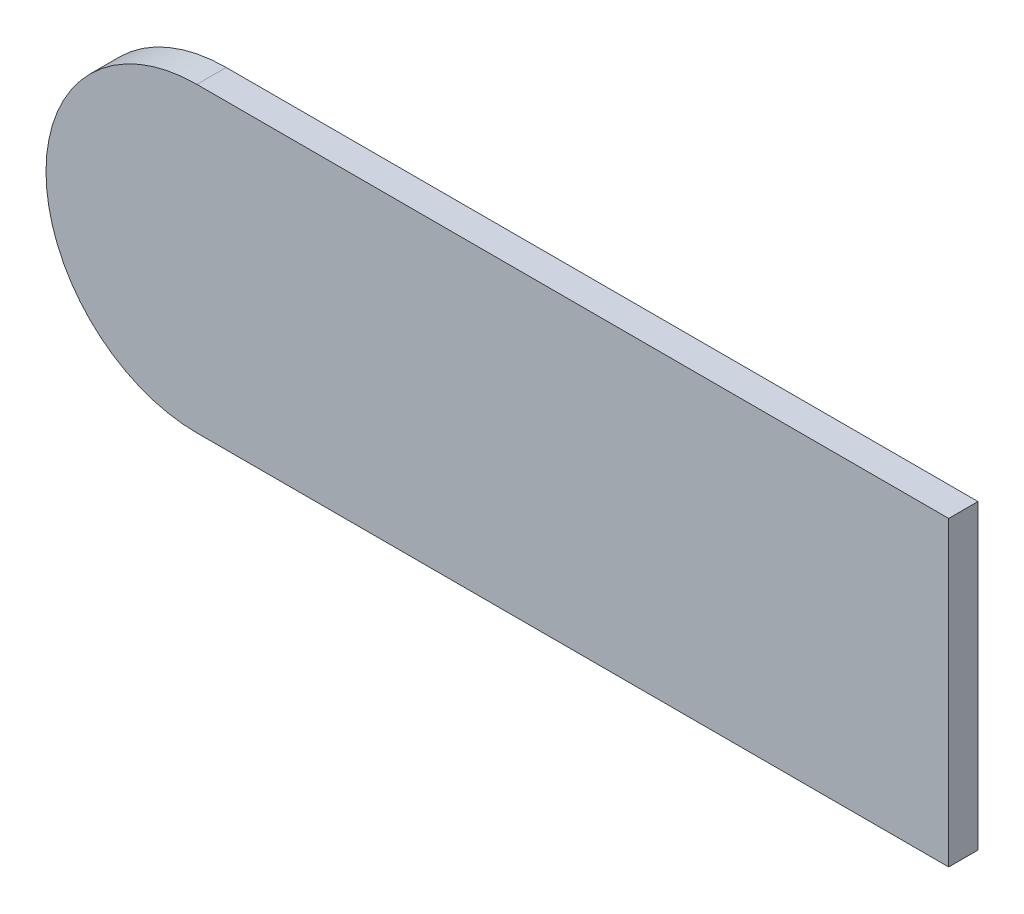
ISO-10303-21;
HEADER;
FILE_DESCRIPTION(('STEP AP214'),'2;1');
FILE_NAME('part.step','',(''),(''),'','','');
FILE_SCHEMA(('AUTOMOTIVE_DESIGN { 1 0 10303 214 1 1 1 1 }'));
ENDSEC;
DATA;
#1=APPLICATION_CONTEXT('core data for automotive mechanical design processes');
#2=APPLICATION_PROTOCOL_DEFINITION('international standard','automotive_design',2000,#1);
#3=PRODUCT_CONTEXT('',#1,'mechanical');
#4=PRODUCT('Part','Part','',(#3));
#5=PRODUCT_RELATED_PRODUCT_CATEGORY('part','',(#4));
#6=PRODUCT_DEFINITION_FORMATION('','',#4);
#7=PRODUCT_DEFINITION_CONTEXT('part definition',#1,'design');
#8=PRODUCT_DEFINITION('design','',#6,#7);
#9=PRODUCT_DEFINITION_SHAPE('','',#8);
#10=(LENGTH_UNIT() NAMED_UNIT(*) SI_UNIT(.MILLI.,.METRE.));
#11=(NAMED_UNIT(*) PLANE_ANGLE_UNIT() SI_UNIT($,.RADIAN.));
#12=(NAMED_UNIT(*) SI_UNIT($,.STERADIAN.) SOLID_ANGLE_UNIT());
#13=UNCERTAINTY_MEASURE_WITH_UNIT(LENGTH_MEASURE(1.E-05),#10,'distance_accuracy_value','');
#14=(GEOMETRIC_REPRESENTATION_CONTEXT(3) GLOBAL_UNCERTAINTY_ASSIGNED_CONTEXT((#13)) GLOBAL_UNIT_ASSIGNED_CONTEXT((#10,
#11,#12)) REPRESENTATION_CONTEXT('',''));
#15=CARTESIAN_POINT('',(0.,0.,0.));
#16=DIRECTION('',(0.,0.,1.));
#17=DIRECTION('',(1.,0.,0.));
#18=AXIS2_PLACEMENT_3D('',#15,#16,#17);
#19=CARTESIAN_POINT('',(-12.3042138671329,-1.03740541843096,-11.6632275560423));
#20=DIRECTION('',(0.,0.,1.));
#21=DIRECTION('',(0.,-1.,0.));
#22=AXIS2_PLACEMENT_3D('',#19,#20,#21);
#23=PLANE('',#22);
#24=CARTESIAN_POINT('',(14.8523856548822,-2.86619306511648,-11.6632275560423));
#25=DIRECTION('',(0.,0.,1.));
#26=DIRECTION('',(0.,-1.,0.));
#27=AXIS2_PLACEMENT_3D('',#24,#25,#26);
#28=CIRCLE('',#27,0.267897163083286);
#29=CARTESIAN_POINT('',(14.8523856548822,-2.59829590203319,-11.6632275560423));
#30=VERTEX_POINT('',#29);
#31=CARTESIAN_POINT('',(14.8523856548822,-3.13409022819975,-11.6632275560423));
#32=VERTEX_POINT('',#31);
#33=EDGE_CURVE('E19',#30,#32,#28,.T.);
#34=ORIENTED_EDGE('',*,*,#33,.F.);
#35=DIRECTION('',(1.,0.,0.));
#36=VECTOR('',#35,1.);
#37=CARTESIAN_POINT('',(16.1866805631558,-2.59829590203319,-11.6632275560423));
#38=LINE('',#37,#36);
#39=CARTESIAN_POINT('',(16.1866805631558,-2.59829590203319,-11.6632275560423));
#40=VERTEX_POINT('',#39);
#41=EDGE_CURVE('E57',#40,#30,#38,.F.);
#42=ORIENTED_EDGE('',*,*,#41,.F.);
#43=DIRECTION('',(0.,1.,0.));
#44=VECTOR('',#43,1.);
#45=CARTESIAN_POINT('',(16.1866805631558,-3.13409022819975,-11.6632275560423));
#46=LINE('',#45,#44);
#47=CARTESIAN_POINT('',(16.1866805631558,-3.13409022819975,-11.6632275560423));
#48=VERTEX_POINT('',#47);
#49=EDGE_CURVE('E73',#48,#40,#46,.T.);
#50=ORIENTED_EDGE('',*,*,#49,.F.);
#51=DIRECTION('',(1.,0.,0.));
#52=VECTOR('',#51,1.);
#53=CARTESIAN_POINT('',(16.1866805631558,-3.13409022819975,-11.6632275560423));
#54=LINE('',#53,#52);
#55=EDGE_CURVE('E59',#32,#48,#54,.T.);
#56=ORIENTED_EDGE('',*,*,#55,.F.);
#57=EDGE_LOOP('',(#34,#42,#50,#56));
#58=FACE_BOUND('',#57,.T.);
#59=ADVANCED_FACE('F16',(#58),#23,.F.);
#60=CARTESIAN_POINT('',(14.8523856548822,-2.86619306511648,-11.6112275560423));
#61=DIRECTION('',(0.,0.,1.));
#62=DIRECTION('',(0.,-1.,0.));
#63=AXIS2_PLACEMENT_3D('',#60,#61,#62);
#64=CYLINDRICAL_SURFACE('',#63,0.267897163083286);
#65=ORIENTED_EDGE('',*,*,#33,.T.);
#66=DIRECTION('',(0.,0.,1.));
#67=VECTOR('',#66,1.);
#68=CARTESIAN_POINT('',(14.8523856548822,-3.13409022819975,-11.6112275560423));
#69=LINE('',#68,#67);
#70=CARTESIAN_POINT('',(14.8523856548822,-3.13409022819975,-11.6112275560423));
#71=VERTEX_POINT('',#70);
#72=EDGE_CURVE('E82',#71,#32,#69,.F.);
#73=ORIENTED_EDGE('',*,*,#72,.F.);
#74=CARTESIAN_POINT('',(14.8523856548822,-2.86619306511648,-11.6112275560423));
#75=DIRECTION('',(0.,0.,1.));
#76=DIRECTION('',(0.,-1.,0.));
#77=AXIS2_PLACEMENT_3D('',#74,#75,#76);
#78=CIRCLE('',#77,0.267897163083286);
#79=CARTESIAN_POINT('',(14.8523856548822,-2.59829590203319,-11.6112275560423));
#80=VERTEX_POINT('',#79);
#81=EDGE_CURVE('E66',#80,#71,#78,.T.);
#82=ORIENTED_EDGE('',*,*,#81,.F.);
#83=DIRECTION('',(0.,0.,1.));
#84=VECTOR('',#83,1.);
#85=CARTESIAN_POINT('',(14.8523856548822,-2.59829590203319,-11.6112275560423));
#86=LINE('',#85,#84);
#87=EDGE_CURVE('E63',#30,#80,#86,.T.);
#88=ORIENTED_EDGE('',*,*,#87,.F.);
#89=EDGE_LOOP('',(#65,#73,#82,#88));
#90=FACE_BOUND('',#89,.T.);
#91=ADVANCED_FACE('F64',(#90),#64,.T.);
#92=CARTESIAN_POINT('',(16.1866805631558,-3.13409022819975,-11.6112275560423));
#93=DIRECTION('',(0.,-1.,0.));
#94=DIRECTION('',(1.,0.,0.));
#95=AXIS2_PLACEMENT_3D('',#92,#93,#94);
#96=PLANE('',#95);
#97=DIRECTION('',(1.,0.,0.));
#98=VECTOR('',#97,1.);
#99=CARTESIAN_POINT('',(-12.3042138671329,-3.13409022819975,-11.6112275560423));
#100=LINE('',#99,#98);
#101=CARTESIAN_POINT('',(16.1866805631558,-3.13409022819975,-11.6112275560423));
#102=VERTEX_POINT('',#101);
#103=EDGE_CURVE('E84',#71,#102,#100,.T.);
#104=ORIENTED_EDGE('',*,*,#103,.F.);
#105=ORIENTED_EDGE('',*,*,#72,.T.);
#106=ORIENTED_EDGE('',*,*,#55,.T.);
#107=DIRECTION('',(0.,0.,-1.));
#108=VECTOR('',#107,1.);
#109=CARTESIAN_POINT('',(16.1866805631558,-3.13409022819975,-11.6112275560423));
#110=LINE('',#109,#108);
#111=EDGE_CURVE('E70',#102,#48,#110,.T.);
#112=ORIENTED_EDGE('',*,*,#111,.F.);
#113=EDGE_LOOP('',(#104,#105,#106,#112));
#114=FACE_BOUND('',#113,.T.);
#115=ADVANCED_FACE('F102',(#114),#96,.T.);
#116=CARTESIAN_POINT('',(16.1866805631558,-3.13409022819975,-11.6112275560423));
#117=DIRECTION('',(1.,0.,0.));
#118=DIRECTION('',(0.,0.,-1.));
#119=AXIS2_PLACEMENT_3D('',#116,#117,#118);
#120=PLANE('',#119);
#121=DIRECTION('',(0.,-1.,0.));
#122=VECTOR('',#121,1.);
#123=CARTESIAN_POINT('',(16.1866805631558,-1.03740541843096,-11.6112275560423));
#124=LINE('',#123,#122);
#125=CARTESIAN_POINT('',(16.1866805631558,-2.59829590203319,-11.6112275560423));
#126=VERTEX_POINT('',#125);
#127=EDGE_CURVE('E25',#102,#126,#124,.F.);
#128=ORIENTED_EDGE('',*,*,#127,.F.);
#129=ORIENTED_EDGE('',*,*,#111,.T.);
#130=ORIENTED_EDGE('',*,*,#49,.T.);
#131=DIRECTION('',(0.,0.,1.));
#132=VECTOR('',#131,1.);
#133=CARTESIAN_POINT('',(16.1866805631558,-2.59829590203319,-11.6112275560423));
#134=LINE('',#133,#132);
#135=EDGE_CURVE('E34',#126,#40,#134,.F.);
#136=ORIENTED_EDGE('',*,*,#135,.F.);
#137=EDGE_LOOP('',(#128,#129,#130,#136));
#138=FACE_BOUND('',#137,.T.);
#139=ADVANCED_FACE('F99',(#138),#120,.T.);
#140=CARTESIAN_POINT('',(16.1866805631558,-2.59829590203319,-11.6112275560423));
#141=DIRECTION('',(0.,1.,0.));
#142=DIRECTION('',(0.,0.,1.));
#143=AXIS2_PLACEMENT_3D('',#140,#141,#142);
#144=PLANE('',#143);
#145=DIRECTION('',(1.,0.,0.));
#146=VECTOR('',#145,1.);
#147=CARTESIAN_POINT('',(-12.3042138671329,-2.59829590203319,-11.6112275560423));
#148=LINE('',#147,#146);
#149=EDGE_CURVE('E11',#126,#80,#148,.F.);
#150=ORIENTED_EDGE('',*,*,#149,.F.);
#151=ORIENTED_EDGE('',*,*,#135,.T.);
#152=ORIENTED_EDGE('',*,*,#41,.T.);
#153=ORIENTED_EDGE('',*,*,#87,.T.);
#154=EDGE_LOOP('',(#150,#151,#152,#153));
#155=FACE_BOUND('',#154,.T.);
#156=ADVANCED_FACE('F69',(#155),#144,.T.);
#157=CARTESIAN_POINT('',(-12.3042138671329,-1.03740541843096,-11.6112275560423));
#158=DIRECTION('',(0.,0.,1.));
#159=DIRECTION('',(0.,-1.,0.));
#160=AXIS2_PLACEMENT_3D('',#157,#158,#159);
#161=PLANE('',#160);
#162=ORIENTED_EDGE('',*,*,#127,.T.);
#163=ORIENTED_EDGE('',*,*,#149,.T.);
#164=ORIENTED_EDGE('',*,*,#81,.T.);
#165=ORIENTED_EDGE('',*,*,#103,.T.);
#166=EDGE_LOOP('',(#162,#163,#164,#165));
#167=FACE_BOUND('',#166,.T.);
#168=ADVANCED_FACE('F103',(#167),#161,.T.);
#169=CLOSED_SHELL('',(#59,#91,#115,#139,#156,#168));
#170=MANIFOLD_SOLID_BREP('B1',#169);
#171=ADVANCED_BREP_SHAPE_REPRESENTATION('',(#18,#170),#14);
#172=SHAPE_DEFINITION_REPRESENTATION(#9,#171);
ENDSEC;
END-ISO-10303-21;
